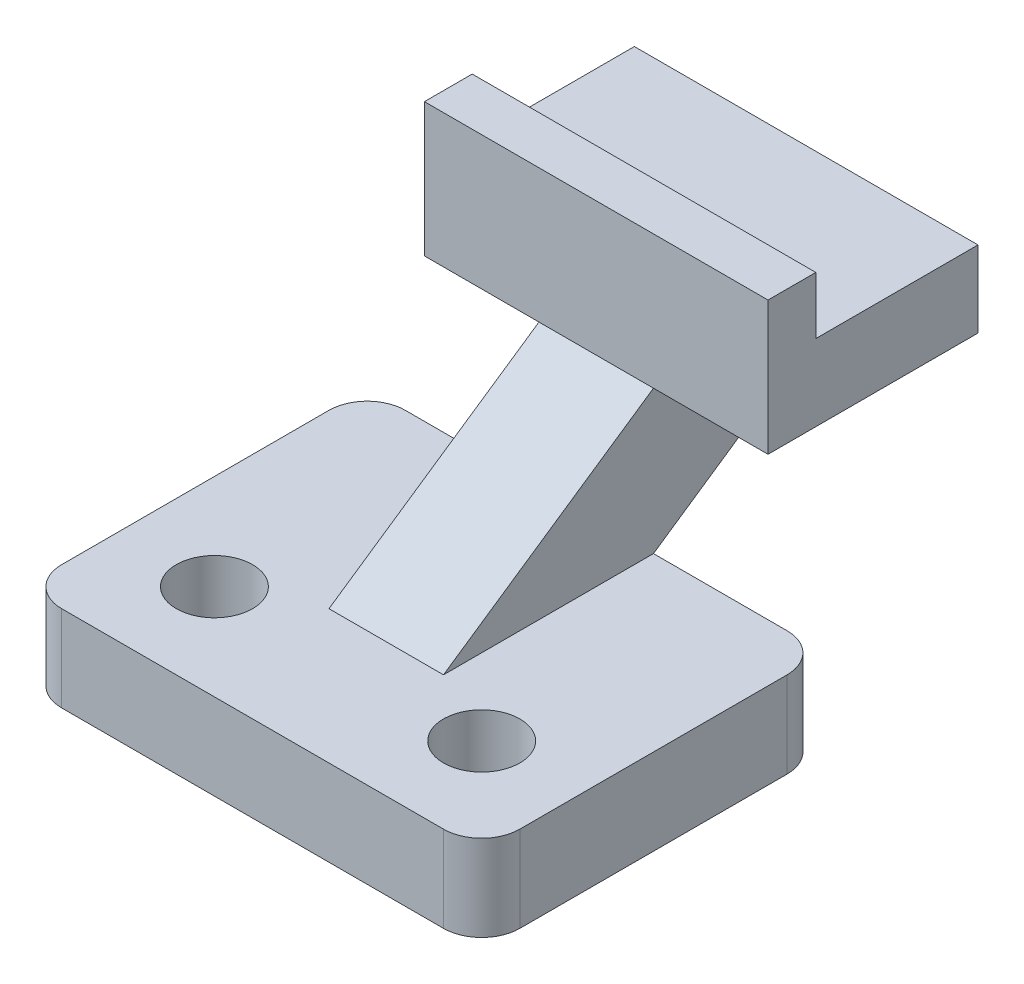
ISO-10303-21;
HEADER;
FILE_DESCRIPTION(('STEP AP214'),'2;1');
FILE_NAME('part.step','',(''),(''),'','','');
FILE_SCHEMA(('AUTOMOTIVE_DESIGN { 1 0 10303 214 1 1 1 1 }'));
ENDSEC;
DATA;
#1=APPLICATION_CONTEXT('core data for automotive mechanical design processes');
#2=APPLICATION_PROTOCOL_DEFINITION('international standard','automotive_design',2000,#1);
#3=PRODUCT_CONTEXT('',#1,'mechanical');
#4=PRODUCT('Part','Part','',(#3));
#5=PRODUCT_RELATED_PRODUCT_CATEGORY('part','',(#4));
#6=PRODUCT_DEFINITION_FORMATION('','',#4);
#7=PRODUCT_DEFINITION_CONTEXT('part definition',#1,'design');
#8=PRODUCT_DEFINITION('design','',#6,#7);
#9=PRODUCT_DEFINITION_SHAPE('','',#8);
#10=(LENGTH_UNIT() NAMED_UNIT(*) SI_UNIT(.MILLI.,.METRE.));
#11=(NAMED_UNIT(*) PLANE_ANGLE_UNIT() SI_UNIT($,.RADIAN.));
#12=(NAMED_UNIT(*) SI_UNIT($,.STERADIAN.) SOLID_ANGLE_UNIT());
#13=UNCERTAINTY_MEASURE_WITH_UNIT(LENGTH_MEASURE(1.E-05),#10,'distance_accuracy_value','');
#14=(GEOMETRIC_REPRESENTATION_CONTEXT(3) GLOBAL_UNCERTAINTY_ASSIGNED_CONTEXT((#13)) GLOBAL_UNIT_ASSIGNED_CONTEXT((#10,
#11,#12)) REPRESENTATION_CONTEXT('',''));
#15=CARTESIAN_POINT('',(0.,0.,0.));
#16=DIRECTION('',(0.,0.,1.));
#17=DIRECTION('',(1.,0.,0.));
#18=AXIS2_PLACEMENT_3D('',#15,#16,#17);
#19=CARTESIAN_POINT('',(-44.0342261904762,23.8252,-49.3447916666667));
#20=DIRECTION('',(1.,0.,0.));
#21=DIRECTION('',(0.,0.,-1.));
#22=AXIS2_PLACEMENT_3D('',#19,#20,#21);
#23=PLANE('',#22);
#24=DIRECTION('',(0.,0.,1.));
#25=VECTOR('',#24,1.);
#26=CARTESIAN_POINT('',(-44.0342261904762,23.8252,-49.3447916666667));
#27=LINE('',#26,#25);
#28=CARTESIAN_POINT('',(-44.0342261904762,23.8252,-49.3447916666667));
#29=VERTEX_POINT('',#28);
#30=CARTESIAN_POINT('',(-44.0342261904762,23.8252,-14.4197916666667));
#31=VERTEX_POINT('',#30);
#32=EDGE_CURVE('E239',#29,#31,#27,.T.);
#33=ORIENTED_EDGE('',*,*,#32,.F.);
#34=DIRECTION('',(0.,-0.563541872734821,0.826087500011065));
#35=VECTOR('',#34,1.);
#36=CARTESIAN_POINT('',(-44.0342261904762,23.8252,-49.3447916666667));
#37=LINE('',#36,#35);
#38=CARTESIAN_POINT('',(-44.0342261904762,0.,-14.4197916666667));
#39=VERTEX_POINT('',#38);
#40=EDGE_CURVE('E223',#29,#39,#37,.T.);
#41=ORIENTED_EDGE('',*,*,#40,.T.);
#42=DIRECTION('',(0.,0.,1.));
#43=VECTOR('',#42,1.);
#44=CARTESIAN_POINT('',(-44.0342261904762,0.,-49.3447916666667));
#45=LINE('',#44,#43);
#46=CARTESIAN_POINT('',(-44.0342261904762,0.,20.5052083333333));
#47=VERTEX_POINT('',#46);
#48=EDGE_CURVE('E251',#39,#47,#45,.T.);
#49=ORIENTED_EDGE('',*,*,#48,.T.);
#50=DIRECTION('',(0.,-0.563541872734821,0.826087500011065));
#51=VECTOR('',#50,1.);
#52=CARTESIAN_POINT('',(-44.0342261904762,40.0840062707072,-38.2533296434497));
#53=LINE('',#52,#51);
#54=EDGE_CURVE('E244',#31,#47,#53,.T.);
#55=ORIENTED_EDGE('',*,*,#54,.F.);
#56=EDGE_LOOP('',(#33,#41,#49,#55));
#57=FACE_BOUND('',#56,.T.);
#58=ADVANCED_FACE('F26',(#57),#23,.F.);
#59=CARTESIAN_POINT('',(-24.9842261904762,23.8252,20.5052083333333));
#60=DIRECTION('',(-1.,0.,0.));
#61=DIRECTION('',(0.,0.,1.));
#62=AXIS2_PLACEMENT_3D('',#59,#60,#61);
#63=PLANE('',#62);
#64=DIRECTION('',(0.,0.,-1.));
#65=VECTOR('',#64,1.);
#66=CARTESIAN_POINT('',(-24.9842261904762,0.,20.5052083333333));
#67=LINE('',#66,#65);
#68=CARTESIAN_POINT('',(-24.9842261904762,0.,20.5052083333333));
#69=VERTEX_POINT('',#68);
#70=CARTESIAN_POINT('',(-24.9842261904762,0.,-14.4197916666667));
#71=VERTEX_POINT('',#70);
#72=EDGE_CURVE('E240',#69,#71,#67,.T.);
#73=ORIENTED_EDGE('',*,*,#72,.T.);
#74=DIRECTION('',(0.,0.563541872734821,-0.826087500011065));
#75=VECTOR('',#74,1.);
#76=CARTESIAN_POINT('',(-24.9842261904762,-8.69241254141447,-1.67771571310069));
#77=LINE('',#76,#75);
#78=CARTESIAN_POINT('',(-24.9842261904762,23.8252,-49.3447916666667));
#79=VERTEX_POINT('',#78);
#80=EDGE_CURVE('E221',#71,#79,#77,.T.);
#81=ORIENTED_EDGE('',*,*,#80,.T.);
#82=DIRECTION('',(0.,0.,-1.));
#83=VECTOR('',#82,1.);
#84=CARTESIAN_POINT('',(-24.9842261904762,23.8252,20.5052083333333));
#85=LINE('',#84,#83);
#86=CARTESIAN_POINT('',(-24.9842261904762,23.8252,-14.4197916666667));
#87=VERTEX_POINT('',#86);
#88=EDGE_CURVE('E233',#87,#79,#85,.T.);
#89=ORIENTED_EDGE('',*,*,#88,.F.);
#90=DIRECTION('',(0.,0.563541872734821,-0.826087500011065));
#91=VECTOR('',#90,1.);
#92=CARTESIAN_POINT('',(-24.9842261904762,7.56639372929277,9.41374631011633));
#93=LINE('',#92,#91);
#94=EDGE_CURVE('E229',#69,#87,#93,.T.);
#95=ORIENTED_EDGE('',*,*,#94,.F.);
#96=EDGE_LOOP('',(#73,#81,#89,#95));
#97=FACE_BOUND('',#96,.T.);
#98=ADVANCED_FACE('F309',(#97),#63,.F.);
#99=CARTESIAN_POINT('',(3.5907738095238,-14.3002,14.1552083333333));
#100=DIRECTION('',(-1.,0.,0.));
#101=DIRECTION('',(0.,0.,1.));
#102=AXIS2_PLACEMENT_3D('',#99,#100,#101);
#103=PLANE('',#102);
#104=DIRECTION('',(0.,0.,1.));
#105=VECTOR('',#104,1.);
#106=CARTESIAN_POINT('',(3.5907738095238,-14.3002,14.1552083333333));
#107=LINE('',#106,#105);
#108=CARTESIAN_POINT('',(3.5907738095238,-14.3002,-8.06979166666667));
#109=VERTEX_POINT('',#108);
#110=CARTESIAN_POINT('',(3.5907738095238,-14.3002,36.3802083333333));
#111=VERTEX_POINT('',#110);
#112=EDGE_CURVE('E284',#109,#111,#107,.T.);
#113=ORIENTED_EDGE('',*,*,#112,.F.);
#114=DIRECTION('',(0.,1.,0.));
#115=VECTOR('',#114,1.);
#116=CARTESIAN_POINT('',(3.5907738095238,-14.3002,-8.06979166666667));
#117=LINE('',#116,#115);
#118=CARTESIAN_POINT('',(3.5907738095238,0.,-8.06979166666667));
#119=VERTEX_POINT('',#118);
#120=EDGE_CURVE('E330',#109,#119,#117,.T.);
#121=ORIENTED_EDGE('',*,*,#120,.T.);
#122=DIRECTION('',(0.,0.,1.));
#123=VECTOR('',#122,1.);
#124=CARTESIAN_POINT('',(3.5907738095238,0.,14.1552083333333));
#125=LINE('',#124,#123);
#126=CARTESIAN_POINT('',(3.5907738095238,0.,36.3802083333333));
#127=VERTEX_POINT('',#126);
#128=EDGE_CURVE('E265',#119,#127,#125,.T.);
#129=ORIENTED_EDGE('',*,*,#128,.T.);
#130=DIRECTION('',(0.,1.,0.));
#131=VECTOR('',#130,1.);
#132=CARTESIAN_POINT('',(3.5907738095238,-14.3002,36.3802083333333));
#133=LINE('',#132,#131);
#134=EDGE_CURVE('E250',#127,#111,#133,.F.);
#135=ORIENTED_EDGE('',*,*,#134,.T.);
#136=EDGE_LOOP('',(#113,#121,#129,#135));
#137=FACE_BOUND('',#136,.T.);
#138=ADVANCED_FACE('F28',(#137),#103,.F.);
#139=CARTESIAN_POINT('',(-108.737760545534,-14.3002,42.7302083333333));
#140=DIRECTION('',(0.,0.,1.));
#141=DIRECTION('',(1.,0.,0.));
#142=AXIS2_PLACEMENT_3D('',#139,#140,#141);
#143=PLANE('',#142);
#144=DIRECTION('',(1.,0.,0.));
#145=VECTOR('',#144,1.);
#146=CARTESIAN_POINT('',(-108.737760545534,-14.3002,42.7302083333333));
#147=LINE('',#146,#145);
#148=CARTESIAN_POINT('',(-66.2592261904762,-14.3002,42.7302083333333));
#149=VERTEX_POINT('',#148);
#150=CARTESIAN_POINT('',(-2.75922619047619,-14.3002,42.7302083333333));
#151=VERTEX_POINT('',#150);
#152=EDGE_CURVE('E292',#149,#151,#147,.T.);
#153=ORIENTED_EDGE('',*,*,#152,.T.);
#154=DIRECTION('',(0.,1.,0.));
#155=VECTOR('',#154,1.);
#156=CARTESIAN_POINT('',(-2.75922619047619,0.,42.7302083333333));
#157=LINE('',#156,#155);
#158=CARTESIAN_POINT('',(-2.75922619047619,0.,42.7302083333333));
#159=VERTEX_POINT('',#158);
#160=EDGE_CURVE('E337',#151,#159,#157,.T.);
#161=ORIENTED_EDGE('',*,*,#160,.T.);
#162=DIRECTION('',(1.,0.,0.));
#163=VECTOR('',#162,1.);
#164=CARTESIAN_POINT('',(-108.737760545534,0.,42.7302083333333));
#165=LINE('',#164,#163);
#166=CARTESIAN_POINT('',(-66.2592261904762,0.,42.7302083333333));
#167=VERTEX_POINT('',#166);
#168=EDGE_CURVE('E275',#167,#159,#165,.T.);
#169=ORIENTED_EDGE('',*,*,#168,.F.);
#170=DIRECTION('',(0.,1.,0.));
#171=VECTOR('',#170,1.);
#172=CARTESIAN_POINT('',(-66.2592261904762,-14.3002,42.7302083333333));
#173=LINE('',#172,#171);
#174=EDGE_CURVE('E339',#167,#149,#173,.F.);
#175=ORIENTED_EDGE('',*,*,#174,.T.);
#176=EDGE_LOOP('',(#153,#161,#169,#175));
#177=FACE_BOUND('',#176,.T.);
#178=ADVANCED_FACE('F373',(#177),#143,.T.);
#179=CARTESIAN_POINT('',(-72.6092261904762,-14.3002,14.1552083333333));
#180=DIRECTION('',(-1.,0.,0.));
#181=DIRECTION('',(0.,0.,1.));
#182=AXIS2_PLACEMENT_3D('',#179,#180,#181);
#183=PLANE('',#182);
#184=DIRECTION('',(0.,0.,1.));
#185=VECTOR('',#184,1.);
#186=CARTESIAN_POINT('',(-72.6092261904762,-14.3002,14.1552083333333));
#187=LINE('',#186,#185);
#188=CARTESIAN_POINT('',(-72.6092261904762,-14.3002,-8.06979166666667));
#189=VERTEX_POINT('',#188);
#190=CARTESIAN_POINT('',(-72.6092261904762,-14.3002,36.3802083333333));
#191=VERTEX_POINT('',#190);
#192=EDGE_CURVE('E290',#189,#191,#187,.T.);
#193=ORIENTED_EDGE('',*,*,#192,.T.);
#194=DIRECTION('',(0.,1.,0.));
#195=VECTOR('',#194,1.);
#196=CARTESIAN_POINT('',(-72.6092261904762,-14.3002,36.3802083333333));
#197=LINE('',#196,#195);
#198=CARTESIAN_POINT('',(-72.6092261904762,0.,36.3802083333333));
#199=VERTEX_POINT('',#198);
#200=EDGE_CURVE('E11',#191,#199,#197,.T.);
#201=ORIENTED_EDGE('',*,*,#200,.T.);
#202=DIRECTION('',(0.,0.,1.));
#203=VECTOR('',#202,1.);
#204=CARTESIAN_POINT('',(-72.6092261904762,0.,14.1552083333333));
#205=LINE('',#204,#203);
#206=CARTESIAN_POINT('',(-72.6092261904762,0.,-8.06979166666667));
#207=VERTEX_POINT('',#206);
#208=EDGE_CURVE('E271',#207,#199,#205,.T.);
#209=ORIENTED_EDGE('',*,*,#208,.F.);
#210=DIRECTION('',(0.,1.,0.));
#211=VECTOR('',#210,1.);
#212=CARTESIAN_POINT('',(-72.6092261904762,-14.3002,-8.06979166666668));
#213=LINE('',#212,#211);
#214=EDGE_CURVE('E34',#207,#189,#213,.F.);
#215=ORIENTED_EDGE('',*,*,#214,.T.);
#216=EDGE_LOOP('',(#193,#201,#209,#215));
#217=FACE_BOUND('',#216,.T.);
#218=ADVANCED_FACE('F332',(#217),#183,.T.);
#219=CARTESIAN_POINT('',(-12.2842261904762,-14.3002,26.8552083333333));
#220=DIRECTION('',(0.,1.,0.));
#221=DIRECTION('',(0.,0.,1.));
#222=AXIS2_PLACEMENT_3D('',#219,#220,#221);
#223=CYLINDRICAL_SURFACE('',#222,6.35);
#224=CARTESIAN_POINT('',(-12.2842261904762,-14.3002,26.8552083333333));
#225=DIRECTION('',(0.,1.,0.));
#226=DIRECTION('',(0.,0.,1.));
#227=AXIS2_PLACEMENT_3D('',#224,#225,#226);
#228=CIRCLE('',#227,6.35);
#229=CARTESIAN_POINT('',(-12.2842261904762,-14.3002,33.2052083333333));
#230=VERTEX_POINT('',#229);
#231=EDGE_CURVE('E295',#230,#230,#228,.T.);
#232=ORIENTED_EDGE('',*,*,#231,.F.);
#233=EDGE_LOOP('',(#232));
#234=FACE_BOUND('',#233,.T.);
#235=CARTESIAN_POINT('',(-12.2842261904762,0.,26.8552083333333));
#236=DIRECTION('',(0.,1.,0.));
#237=DIRECTION('',(0.,0.,1.));
#238=AXIS2_PLACEMENT_3D('',#235,#236,#237);
#239=CIRCLE('',#238,6.35);
#240=CARTESIAN_POINT('',(-12.2842261904762,0.,33.2052083333333));
#241=VERTEX_POINT('',#240);
#242=EDGE_CURVE('E278',#241,#241,#239,.T.);
#243=ORIENTED_EDGE('',*,*,#242,.T.);
#244=EDGE_LOOP('',(#243));
#245=FACE_BOUND('',#244,.T.);
#246=ADVANCED_FACE('F404',(#234,#245),#223,.F.);
#247=CARTESIAN_POINT('',(-108.737760545534,-14.3002,-14.4197916666667));
#248=DIRECTION('',(0.,0.,1.));
#249=DIRECTION('',(1.,0.,0.));
#250=AXIS2_PLACEMENT_3D('',#247,#248,#249);
#251=PLANE('',#250);
#252=DIRECTION('',(1.,0.,0.));
#253=VECTOR('',#252,1.);
#254=CARTESIAN_POINT('',(-108.737760545534,0.,-14.4197916666667));
#255=LINE('',#254,#253);
#256=CARTESIAN_POINT('',(-2.75922619047619,0.,-14.4197916666667));
#257=VERTEX_POINT('',#256);
#258=EDGE_CURVE('E268',#71,#257,#255,.T.);
#259=ORIENTED_EDGE('',*,*,#258,.T.);
#260=DIRECTION('',(0.,1.,0.));
#261=VECTOR('',#260,1.);
#262=CARTESIAN_POINT('',(-2.75922619047619,-14.3002,-14.4197916666667));
#263=LINE('',#262,#261);
#264=CARTESIAN_POINT('',(-2.75922619047619,-14.3002,-14.4197916666667));
#265=VERTEX_POINT('',#264);
#266=EDGE_CURVE('E349',#257,#265,#263,.F.);
#267=ORIENTED_EDGE('',*,*,#266,.T.);
#268=DIRECTION('',(1.,0.,0.));
#269=VECTOR('',#268,1.);
#270=CARTESIAN_POINT('',(-108.737760545534,-14.3002,-14.4197916666667));
#271=LINE('',#270,#269);
#272=CARTESIAN_POINT('',(-66.2592261904762,-14.3002,-14.4197916666667));
#273=VERTEX_POINT('',#272);
#274=EDGE_CURVE('E287',#273,#265,#271,.T.);
#275=ORIENTED_EDGE('',*,*,#274,.F.);
#276=DIRECTION('',(0.,1.,0.));
#277=VECTOR('',#276,1.);
#278=CARTESIAN_POINT('',(-66.2592261904762,0.,-14.4197916666667));
#279=LINE('',#278,#277);
#280=CARTESIAN_POINT('',(-66.2592261904762,0.,-14.4197916666667));
#281=VERTEX_POINT('',#280);
#282=EDGE_CURVE('E351',#273,#281,#279,.T.);
#283=ORIENTED_EDGE('',*,*,#282,.T.);
#284=EDGE_CURVE('E269',#281,#39,#255,.T.);
#285=ORIENTED_EDGE('',*,*,#284,.T.);
#286=EDGE_CURVE('E272',#39,#71,#255,.T.);
#287=ORIENTED_EDGE('',*,*,#286,.T.);
#288=EDGE_LOOP('',(#259,#267,#275,#283,#285,#287));
#289=FACE_BOUND('',#288,.T.);
#290=ADVANCED_FACE('F320',(#289),#251,.F.);
#291=CARTESIAN_POINT('',(-56.7342261904762,-14.3002,26.8552083333333));
#292=DIRECTION('',(0.,1.,0.));
#293=DIRECTION('',(0.,0.,1.));
#294=AXIS2_PLACEMENT_3D('',#291,#292,#293);
#295=CYLINDRICAL_SURFACE('',#294,6.35);
#296=CARTESIAN_POINT('',(-56.7342261904762,-14.3002,26.8552083333333));
#297=DIRECTION('',(0.,1.,0.));
#298=DIRECTION('',(0.,0.,1.));
#299=AXIS2_PLACEMENT_3D('',#296,#297,#298);
#300=CIRCLE('',#299,6.35);
#301=CARTESIAN_POINT('',(-56.7342261904762,-14.3002,33.2052083333333));
#302=VERTEX_POINT('',#301);
#303=EDGE_CURVE('E297',#302,#302,#300,.T.);
#304=ORIENTED_EDGE('',*,*,#303,.F.);
#305=EDGE_LOOP('',(#304));
#306=FACE_BOUND('',#305,.T.);
#307=CARTESIAN_POINT('',(-56.7342261904762,0.,26.8552083333333));
#308=DIRECTION('',(0.,1.,0.));
#309=DIRECTION('',(0.,0.,1.));
#310=AXIS2_PLACEMENT_3D('',#307,#308,#309);
#311=CIRCLE('',#310,6.35);
#312=CARTESIAN_POINT('',(-56.7342261904762,0.,33.2052083333333));
#313=VERTEX_POINT('',#312);
#314=EDGE_CURVE('E281',#313,#313,#311,.T.);
#315=ORIENTED_EDGE('',*,*,#314,.T.);
#316=EDGE_LOOP('',(#315));
#317=FACE_BOUND('',#316,.T.);
#318=ADVANCED_FACE('F401',(#306,#317),#295,.F.);
#319=CARTESIAN_POINT('',(-108.737760545534,-14.3002,14.1552083333333));
#320=DIRECTION('',(0.,1.,0.));
#321=DIRECTION('',(0.,0.,1.));
#322=AXIS2_PLACEMENT_3D('',#319,#320,#321);
#323=PLANE('',#322);
#324=ORIENTED_EDGE('',*,*,#274,.T.);
#325=CARTESIAN_POINT('',(-2.7592261904762,-14.3002,-8.06979166666667));
#326=DIRECTION('',(0.,1.,0.));
#327=DIRECTION('',(0.,0.,1.));
#328=AXIS2_PLACEMENT_3D('',#325,#326,#327);
#329=CIRCLE('',#328,6.35);
#330=EDGE_CURVE('E343',#265,#109,#329,.F.);
#331=ORIENTED_EDGE('',*,*,#330,.T.);
#332=ORIENTED_EDGE('',*,*,#112,.T.);
#333=CARTESIAN_POINT('',(-2.75922619047619,-14.3002,36.3802083333333));
#334=DIRECTION('',(0.,1.,0.));
#335=DIRECTION('',(0.,0.,1.));
#336=AXIS2_PLACEMENT_3D('',#333,#334,#335);
#337=CIRCLE('',#336,6.35);
#338=EDGE_CURVE('E345',#111,#151,#337,.F.);
#339=ORIENTED_EDGE('',*,*,#338,.T.);
#340=ORIENTED_EDGE('',*,*,#152,.F.);
#341=CARTESIAN_POINT('',(-66.2592261904762,-14.3002,36.3802083333333));
#342=DIRECTION('',(0.,1.,0.));
#343=DIRECTION('',(0.,0.,1.));
#344=AXIS2_PLACEMENT_3D('',#341,#342,#343);
#345=CIRCLE('',#344,6.35);
#346=EDGE_CURVE('E41',#149,#191,#345,.F.);
#347=ORIENTED_EDGE('',*,*,#346,.T.);
#348=ORIENTED_EDGE('',*,*,#192,.F.);
#349=CARTESIAN_POINT('',(-66.2592261904762,-14.3002,-8.06979166666668));
#350=DIRECTION('',(0.,1.,0.));
#351=DIRECTION('',(0.,0.,1.));
#352=AXIS2_PLACEMENT_3D('',#349,#350,#351);
#353=CIRCLE('',#352,6.35);
#354=EDGE_CURVE('E336',#189,#273,#353,.F.);
#355=ORIENTED_EDGE('',*,*,#354,.T.);
#356=EDGE_LOOP('',(#324,#331,#332,#339,#340,#347,#348,#355));
#357=FACE_BOUND('',#356,.T.);
#358=ORIENTED_EDGE('',*,*,#231,.T.);
#359=EDGE_LOOP('',(#358));
#360=FACE_BOUND('',#359,.T.);
#361=ORIENTED_EDGE('',*,*,#303,.T.);
#362=EDGE_LOOP('',(#361));
#363=FACE_BOUND('',#362,.T.);
#364=ADVANCED_FACE('F366',(#357,#360,#363),#323,.F.);
#365=CARTESIAN_POINT('',(-108.737760545534,0.,14.1552083333333));
#366=DIRECTION('',(0.,1.,0.));
#367=DIRECTION('',(0.,0.,1.));
#368=AXIS2_PLACEMENT_3D('',#365,#366,#367);
#369=PLANE('',#368);
#370=ORIENTED_EDGE('',*,*,#314,.F.);
#371=EDGE_LOOP('',(#370));
#372=FACE_BOUND('',#371,.T.);
#373=ORIENTED_EDGE('',*,*,#242,.F.);
#374=EDGE_LOOP('',(#373));
#375=FACE_BOUND('',#374,.T.);
#376=ORIENTED_EDGE('',*,*,#128,.F.);
#377=CARTESIAN_POINT('',(-2.7592261904762,0.,-8.06979166666667));
#378=DIRECTION('',(0.,1.,0.));
#379=DIRECTION('',(0.,0.,1.));
#380=AXIS2_PLACEMENT_3D('',#377,#378,#379);
#381=CIRCLE('',#380,6.35);
#382=EDGE_CURVE('E316',#119,#257,#381,.T.);
#383=ORIENTED_EDGE('',*,*,#382,.T.);
#384=ORIENTED_EDGE('',*,*,#258,.F.);
#385=ORIENTED_EDGE('',*,*,#72,.F.);
#386=DIRECTION('',(1.,0.,0.));
#387=VECTOR('',#386,1.);
#388=CARTESIAN_POINT('',(-44.0342261904762,0.,20.5052083333333));
#389=LINE('',#388,#387);
#390=EDGE_CURVE('E255',#47,#69,#389,.T.);
#391=ORIENTED_EDGE('',*,*,#390,.F.);
#392=ORIENTED_EDGE('',*,*,#48,.F.);
#393=ORIENTED_EDGE('',*,*,#284,.F.);
#394=CARTESIAN_POINT('',(-66.2592261904762,0.,-8.06979166666668));
#395=DIRECTION('',(0.,1.,0.));
#396=DIRECTION('',(0.,0.,1.));
#397=AXIS2_PLACEMENT_3D('',#394,#395,#396);
#398=CIRCLE('',#397,6.35);
#399=EDGE_CURVE('E326',#281,#207,#398,.T.);
#400=ORIENTED_EDGE('',*,*,#399,.T.);
#401=ORIENTED_EDGE('',*,*,#208,.T.);
#402=CARTESIAN_POINT('',(-66.2592261904762,0.,36.3802083333333));
#403=DIRECTION('',(0.,1.,0.));
#404=DIRECTION('',(0.,0.,1.));
#405=AXIS2_PLACEMENT_3D('',#402,#403,#404);
#406=CIRCLE('',#405,6.35);
#407=EDGE_CURVE('E329',#199,#167,#406,.T.);
#408=ORIENTED_EDGE('',*,*,#407,.T.);
#409=ORIENTED_EDGE('',*,*,#168,.T.);
#410=CARTESIAN_POINT('',(-2.75922619047619,0.,36.3802083333333));
#411=DIRECTION('',(0.,1.,0.));
#412=DIRECTION('',(0.,0.,1.));
#413=AXIS2_PLACEMENT_3D('',#410,#411,#412);
#414=CIRCLE('',#413,6.35);
#415=EDGE_CURVE('E354',#159,#127,#414,.T.);
#416=ORIENTED_EDGE('',*,*,#415,.T.);
#417=EDGE_LOOP('',(#376,#383,#384,#385,#391,#392,#393,#400,#401,#408,#409,#416));
#418=FACE_BOUND('',#417,.T.);
#419=ADVANCED_FACE('F313',(#372,#375,#418),#369,.T.);
#420=CARTESIAN_POINT('',(3.59077380952381,46.8314523306339,-48.1443086758582));
#421=DIRECTION('',(0.,0.826087500011065,0.563541872734821));
#422=DIRECTION('',(0.,-0.563541872734821,0.826087500011065));
#423=AXIS2_PLACEMENT_3D('',#420,#421,#422);
#424=PLANE('',#423);
#425=ORIENTED_EDGE('',*,*,#54,.T.);
#426=ORIENTED_EDGE('',*,*,#390,.T.);
#427=ORIENTED_EDGE('',*,*,#94,.T.);
#428=DIRECTION('',(1.,0.,0.));
#429=VECTOR('',#428,1.);
#430=CARTESIAN_POINT('',(-44.0342261904762,23.8252,-14.4197916666667));
#431=LINE('',#430,#429);
#432=EDGE_CURVE('E247',#31,#87,#431,.T.);
#433=ORIENTED_EDGE('',*,*,#432,.F.);
#434=EDGE_LOOP('',(#425,#426,#427,#433));
#435=FACE_BOUND('',#434,.T.);
#436=ADVANCED_FACE('F397',(#435),#424,.T.);
#437=CARTESIAN_POINT('',(-200.847170839906,23.8252,-49.3447916666667));
#438=DIRECTION('',(0.,0.826087500011065,0.563541872734821));
#439=DIRECTION('',(0.,-0.563541872734821,0.826087500011065));
#440=AXIS2_PLACEMENT_3D('',#437,#438,#439);
#441=PLANE('',#440);
#442=ORIENTED_EDGE('',*,*,#40,.F.);
#443=DIRECTION('',(-1.,0.,0.));
#444=VECTOR('',#443,1.);
#445=CARTESIAN_POINT('',(-24.9842261904762,23.8252,-49.3447916666667));
#446=LINE('',#445,#444);
#447=EDGE_CURVE('E160',#79,#29,#446,.T.);
#448=ORIENTED_EDGE('',*,*,#447,.F.);
#449=ORIENTED_EDGE('',*,*,#80,.F.);
#450=ORIENTED_EDGE('',*,*,#286,.F.);
#451=EDGE_LOOP('',(#442,#448,#449,#450));
#452=FACE_BOUND('',#451,.T.);
#453=ADVANCED_FACE('F324',(#452),#441,.F.);
#454=CARTESIAN_POINT('',(-5.9342261904762,23.8252,-14.4197916666667));
#455=DIRECTION('',(0.,1.,0.));
#456=DIRECTION('',(0.,0.,1.));
#457=AXIS2_PLACEMENT_3D('',#454,#455,#456);
#458=PLANE('',#457);
#459=DIRECTION('',(-1.,0.,0.));
#460=VECTOR('',#459,1.);
#461=CARTESIAN_POINT('',(-5.9342261904762,23.8252,-49.3447916666667));
#462=LINE('',#461,#460);
#463=CARTESIAN_POINT('',(-63.0842261904762,23.8252,-49.3447916666667));
#464=VERTEX_POINT('',#463);
#465=EDGE_CURVE('E153',#29,#464,#462,.T.);
#466=ORIENTED_EDGE('',*,*,#465,.F.);
#467=ORIENTED_EDGE('',*,*,#32,.T.);
#468=DIRECTION('',(-1.,0.,0.));
#469=VECTOR('',#468,1.);
#470=CARTESIAN_POINT('',(-5.9342261904762,23.8252,-14.4197916666667));
#471=LINE('',#470,#469);
#472=CARTESIAN_POINT('',(-63.0842261904762,23.8252,-14.4197916666667));
#473=VERTEX_POINT('',#472);
#474=EDGE_CURVE('E180',#31,#473,#471,.T.);
#475=ORIENTED_EDGE('',*,*,#474,.T.);
#476=DIRECTION('',(0.,0.,-1.));
#477=VECTOR('',#476,1.);
#478=CARTESIAN_POINT('',(-63.0842261904762,23.8252,-14.4197916666667));
#479=LINE('',#478,#477);
#480=EDGE_CURVE('E172',#473,#464,#479,.T.);
#481=ORIENTED_EDGE('',*,*,#480,.T.);
#482=EDGE_LOOP('',(#466,#467,#475,#481));
#483=FACE_BOUND('',#482,.T.);
#484=ADVANCED_FACE('F178',(#483),#458,.F.);
#485=CARTESIAN_POINT('',(-5.9342261904762,23.8252,-14.4197916666667));
#486=VERTEX_POINT('',#485);
#487=EDGE_CURVE('E213',#486,#87,#471,.T.);
#488=ORIENTED_EDGE('',*,*,#487,.T.);
#489=ORIENTED_EDGE('',*,*,#88,.T.);
#490=CARTESIAN_POINT('',(-5.9342261904762,23.8252,-49.3447916666667));
#491=VERTEX_POINT('',#490);
#492=EDGE_CURVE('E164',#491,#79,#462,.T.);
#493=ORIENTED_EDGE('',*,*,#492,.F.);
#494=DIRECTION('',(0.,0.,-1.));
#495=VECTOR('',#494,1.);
#496=CARTESIAN_POINT('',(-5.9342261904762,23.8252,-14.4197916666667));
#497=LINE('',#496,#495);
#498=EDGE_CURVE('E192',#486,#491,#497,.T.);
#499=ORIENTED_EDGE('',*,*,#498,.F.);
#500=EDGE_LOOP('',(#488,#489,#493,#499));
#501=FACE_BOUND('',#500,.T.);
#502=ADVANCED_FACE('F500',(#501),#458,.F.);
#503=CARTESIAN_POINT('',(-5.9342261904762,36.5252,-49.3447916666667));
#504=DIRECTION('',(0.,0.,1.));
#505=DIRECTION('',(0.,-1.,0.));
#506=AXIS2_PLACEMENT_3D('',#503,#504,#505);
#507=PLANE('',#506);
#508=ORIENTED_EDGE('',*,*,#492,.T.);
#509=ORIENTED_EDGE('',*,*,#447,.T.);
#510=ORIENTED_EDGE('',*,*,#465,.T.);
#511=DIRECTION('',(0.,1.,0.));
#512=VECTOR('',#511,1.);
#513=CARTESIAN_POINT('',(-63.0842261904762,36.5252,-49.3447916666667));
#514=LINE('',#513,#512);
#515=CARTESIAN_POINT('',(-63.0842261904762,36.5252,-49.3447916666667));
#516=VERTEX_POINT('',#515);
#517=EDGE_CURVE('E158',#464,#516,#514,.T.);
#518=ORIENTED_EDGE('',*,*,#517,.T.);
#519=DIRECTION('',(-1.,0.,0.));
#520=VECTOR('',#519,1.);
#521=CARTESIAN_POINT('',(-5.9342261904762,36.5252,-49.3447916666667));
#522=LINE('',#521,#520);
#523=CARTESIAN_POINT('',(-5.9342261904762,36.5252,-49.3447916666667));
#524=VERTEX_POINT('',#523);
#525=EDGE_CURVE('E165',#524,#516,#522,.T.);
#526=ORIENTED_EDGE('',*,*,#525,.F.);
#527=DIRECTION('',(0.,1.,0.));
#528=VECTOR('',#527,1.);
#529=CARTESIAN_POINT('',(-5.9342261904762,36.5252,-49.3447916666667));
#530=LINE('',#529,#528);
#531=EDGE_CURVE('E195',#491,#524,#530,.T.);
#532=ORIENTED_EDGE('',*,*,#531,.F.);
#533=EDGE_LOOP('',(#508,#509,#510,#518,#526,#532));
#534=FACE_BOUND('',#533,.T.);
#535=ADVANCED_FACE('F156',(#534),#507,.F.);
#536=CARTESIAN_POINT('',(-5.9342261904762,36.5252,-22.3699916666667));
#537=DIRECTION('',(0.,-1.,0.));
#538=DIRECTION('',(0.,0.,-1.));
#539=AXIS2_PLACEMENT_3D('',#536,#537,#538);
#540=PLANE('',#539);
#541=ORIENTED_EDGE('',*,*,#525,.T.);
#542=DIRECTION('',(0.,0.,1.));
#543=VECTOR('',#542,1.);
#544=CARTESIAN_POINT('',(-63.0842261904762,36.5252,-22.3699916666667));
#545=LINE('',#544,#543);
#546=CARTESIAN_POINT('',(-63.0842261904762,36.5252,-22.3699916666667));
#547=VERTEX_POINT('',#546);
#548=EDGE_CURVE('E176',#516,#547,#545,.T.);
#549=ORIENTED_EDGE('',*,*,#548,.T.);
#550=DIRECTION('',(-1.,0.,0.));
#551=VECTOR('',#550,1.);
#552=CARTESIAN_POINT('',(-5.9342261904762,36.5252,-22.3699916666667));
#553=LINE('',#552,#551);
#554=CARTESIAN_POINT('',(-5.9342261904762,36.5252,-22.3699916666667));
#555=VERTEX_POINT('',#554);
#556=EDGE_CURVE('E539',#555,#547,#553,.T.);
#557=ORIENTED_EDGE('',*,*,#556,.F.);
#558=DIRECTION('',(0.,0.,1.));
#559=VECTOR('',#558,1.);
#560=CARTESIAN_POINT('',(-5.9342261904762,36.5252,-22.3699916666667));
#561=LINE('',#560,#559);
#562=EDGE_CURVE('E197',#524,#555,#561,.T.);
#563=ORIENTED_EDGE('',*,*,#562,.F.);
#564=EDGE_LOOP('',(#541,#549,#557,#563));
#565=FACE_BOUND('',#564,.T.);
#566=ADVANCED_FACE('F485',(#565),#540,.F.);
#567=CARTESIAN_POINT('',(-5.9342261904762,46.0502,-22.3699916666667));
#568=DIRECTION('',(0.,0.,1.));
#569=DIRECTION('',(1.,0.,0.));
#570=AXIS2_PLACEMENT_3D('',#567,#568,#569);
#571=PLANE('',#570);
#572=ORIENTED_EDGE('',*,*,#556,.T.);
#573=DIRECTION('',(0.,1.,0.));
#574=VECTOR('',#573,1.);
#575=CARTESIAN_POINT('',(-63.0842261904762,46.0502,-22.3699916666667));
#576=LINE('',#575,#574);
#577=CARTESIAN_POINT('',(-63.0842261904762,46.0502,-22.3699916666667));
#578=VERTEX_POINT('',#577);
#579=EDGE_CURVE('E184',#547,#578,#576,.T.);
#580=ORIENTED_EDGE('',*,*,#579,.T.);
#581=DIRECTION('',(-1.,0.,0.));
#582=VECTOR('',#581,1.);
#583=CARTESIAN_POINT('',(-5.9342261904762,46.0502,-22.3699916666667));
#584=LINE('',#583,#582);
#585=CARTESIAN_POINT('',(-5.9342261904762,46.0502,-22.3699916666667));
#586=VERTEX_POINT('',#585);
#587=EDGE_CURVE('E536',#586,#578,#584,.T.);
#588=ORIENTED_EDGE('',*,*,#587,.F.);
#589=DIRECTION('',(0.,1.,0.));
#590=VECTOR('',#589,1.);
#591=CARTESIAN_POINT('',(-5.9342261904762,46.0502,-22.3699916666667));
#592=LINE('',#591,#590);
#593=EDGE_CURVE('E199',#555,#586,#592,.T.);
#594=ORIENTED_EDGE('',*,*,#593,.F.);
#595=EDGE_LOOP('',(#572,#580,#588,#594));
#596=FACE_BOUND('',#595,.T.);
#597=ADVANCED_FACE('F477',(#596),#571,.F.);
#598=CARTESIAN_POINT('',(-5.9342261904762,46.0502,-14.4197916666667));
#599=DIRECTION('',(0.,-1.,0.));
#600=DIRECTION('',(0.,0.,-1.));
#601=AXIS2_PLACEMENT_3D('',#598,#599,#600);
#602=PLANE('',#601);
#603=ORIENTED_EDGE('',*,*,#587,.T.);
#604=DIRECTION('',(0.,0.,1.));
#605=VECTOR('',#604,1.);
#606=CARTESIAN_POINT('',(-63.0842261904762,46.0502,-14.4197916666667));
#607=LINE('',#606,#605);
#608=CARTESIAN_POINT('',(-63.0842261904762,46.0502,-14.4197916666667));
#609=VERTEX_POINT('',#608);
#610=EDGE_CURVE('E187',#578,#609,#607,.T.);
#611=ORIENTED_EDGE('',*,*,#610,.T.);
#612=DIRECTION('',(-1.,0.,0.));
#613=VECTOR('',#612,1.);
#614=CARTESIAN_POINT('',(-5.9342261904762,46.0502,-14.4197916666667));
#615=LINE('',#614,#613);
#616=CARTESIAN_POINT('',(-5.9342261904762,46.0502,-14.4197916666667));
#617=VERTEX_POINT('',#616);
#618=EDGE_CURVE('E207',#617,#609,#615,.T.);
#619=ORIENTED_EDGE('',*,*,#618,.F.);
#620=DIRECTION('',(0.,0.,1.));
#621=VECTOR('',#620,1.);
#622=CARTESIAN_POINT('',(-5.9342261904762,46.0502,-14.4197916666667));
#623=LINE('',#622,#621);
#624=EDGE_CURVE('E201',#586,#617,#623,.T.);
#625=ORIENTED_EDGE('',*,*,#624,.F.);
#626=EDGE_LOOP('',(#603,#611,#619,#625));
#627=FACE_BOUND('',#626,.T.);
#628=ADVANCED_FACE('F469',(#627),#602,.F.);
#629=CARTESIAN_POINT('',(-5.9342261904762,23.8252,-14.4197916666667));
#630=DIRECTION('',(0.,0.,-1.));
#631=DIRECTION('',(-1.,0.,0.));
#632=AXIS2_PLACEMENT_3D('',#629,#630,#631);
#633=PLANE('',#632);
#634=ORIENTED_EDGE('',*,*,#618,.T.);
#635=DIRECTION('',(0.,-1.,0.));
#636=VECTOR('',#635,1.);
#637=CARTESIAN_POINT('',(-63.0842261904762,23.8252,-14.4197916666667));
#638=LINE('',#637,#636);
#639=EDGE_CURVE('E190',#609,#473,#638,.T.);
#640=ORIENTED_EDGE('',*,*,#639,.T.);
#641=ORIENTED_EDGE('',*,*,#474,.F.);
#642=ORIENTED_EDGE('',*,*,#432,.T.);
#643=ORIENTED_EDGE('',*,*,#487,.F.);
#644=DIRECTION('',(0.,-1.,0.));
#645=VECTOR('',#644,1.);
#646=CARTESIAN_POINT('',(-5.9342261904762,23.8252,-14.4197916666667));
#647=LINE('',#646,#645);
#648=EDGE_CURVE('E203',#617,#486,#647,.T.);
#649=ORIENTED_EDGE('',*,*,#648,.F.);
#650=EDGE_LOOP('',(#634,#640,#641,#642,#643,#649));
#651=FACE_BOUND('',#650,.T.);
#652=ADVANCED_FACE('F461',(#651),#633,.F.);
#653=CARTESIAN_POINT('',(-5.9342261904762,23.8252,-22.3699916666667));
#654=DIRECTION('',(-1.,0.,0.));
#655=DIRECTION('',(0.,0.,1.));
#656=AXIS2_PLACEMENT_3D('',#653,#654,#655);
#657=PLANE('',#656);
#658=ORIENTED_EDGE('',*,*,#498,.T.);
#659=ORIENTED_EDGE('',*,*,#531,.T.);
#660=ORIENTED_EDGE('',*,*,#562,.T.);
#661=ORIENTED_EDGE('',*,*,#593,.T.);
#662=ORIENTED_EDGE('',*,*,#624,.T.);
#663=ORIENTED_EDGE('',*,*,#648,.T.);
#664=EDGE_LOOP('',(#658,#659,#660,#661,#662,#663));
#665=FACE_BOUND('',#664,.T.);
#666=ADVANCED_FACE('F453',(#665),#657,.F.);
#667=CARTESIAN_POINT('',(-63.0842261904762,23.8252,-22.3699916666667));
#668=DIRECTION('',(-1.,0.,0.));
#669=DIRECTION('',(0.,0.,1.));
#670=AXIS2_PLACEMENT_3D('',#667,#668,#669);
#671=PLANE('',#670);
#672=ORIENTED_EDGE('',*,*,#480,.F.);
#673=ORIENTED_EDGE('',*,*,#639,.F.);
#674=ORIENTED_EDGE('',*,*,#610,.F.);
#675=ORIENTED_EDGE('',*,*,#579,.F.);
#676=ORIENTED_EDGE('',*,*,#548,.F.);
#677=ORIENTED_EDGE('',*,*,#517,.F.);
#678=EDGE_LOOP('',(#672,#673,#674,#675,#676,#677));
#679=FACE_BOUND('',#678,.T.);
#680=ADVANCED_FACE('F170',(#679),#671,.T.);
#681=CARTESIAN_POINT('',(-2.7592261904762,-14.3002,-8.06979166666667));
#682=DIRECTION('',(0.,1.,0.));
#683=DIRECTION('',(0.,0.,1.));
#684=AXIS2_PLACEMENT_3D('',#681,#682,#683);
#685=CYLINDRICAL_SURFACE('',#684,6.35);
#686=ORIENTED_EDGE('',*,*,#330,.F.);
#687=ORIENTED_EDGE('',*,*,#266,.F.);
#688=ORIENTED_EDGE('',*,*,#382,.F.);
#689=ORIENTED_EDGE('',*,*,#120,.F.);
#690=EDGE_LOOP('',(#686,#687,#688,#689));
#691=FACE_BOUND('',#690,.T.);
#692=ADVANCED_FACE('F384',(#691),#685,.T.);
#693=CARTESIAN_POINT('',(-2.75922619047619,-14.3002,36.3802083333333));
#694=DIRECTION('',(0.,-1.,0.));
#695=DIRECTION('',(0.,0.,-1.));
#696=AXIS2_PLACEMENT_3D('',#693,#694,#695);
#697=CYLINDRICAL_SURFACE('',#696,6.35);
#698=ORIENTED_EDGE('',*,*,#338,.F.);
#699=ORIENTED_EDGE('',*,*,#134,.F.);
#700=ORIENTED_EDGE('',*,*,#415,.F.);
#701=ORIENTED_EDGE('',*,*,#160,.F.);
#702=EDGE_LOOP('',(#698,#699,#700,#701));
#703=FACE_BOUND('',#702,.T.);
#704=ADVANCED_FACE('F370',(#703),#697,.T.);
#705=CARTESIAN_POINT('',(-66.2592261904762,-14.3002,36.3802083333333));
#706=DIRECTION('',(0.,1.,0.));
#707=DIRECTION('',(0.,0.,1.));
#708=AXIS2_PLACEMENT_3D('',#705,#706,#707);
#709=CYLINDRICAL_SURFACE('',#708,6.35);
#710=ORIENTED_EDGE('',*,*,#346,.F.);
#711=ORIENTED_EDGE('',*,*,#174,.F.);
#712=ORIENTED_EDGE('',*,*,#407,.F.);
#713=ORIENTED_EDGE('',*,*,#200,.F.);
#714=EDGE_LOOP('',(#710,#711,#712,#713));
#715=FACE_BOUND('',#714,.T.);
#716=ADVANCED_FACE('F376',(#715),#709,.T.);
#717=CARTESIAN_POINT('',(-66.2592261904762,-14.3002,-8.06979166666668));
#718=DIRECTION('',(0.,-1.,0.));
#719=DIRECTION('',(0.,0.,-1.));
#720=AXIS2_PLACEMENT_3D('',#717,#718,#719);
#721=CYLINDRICAL_SURFACE('',#720,6.35);
#722=ORIENTED_EDGE('',*,*,#354,.F.);
#723=ORIENTED_EDGE('',*,*,#214,.F.);
#724=ORIENTED_EDGE('',*,*,#399,.F.);
#725=ORIENTED_EDGE('',*,*,#282,.F.);
#726=EDGE_LOOP('',(#722,#723,#724,#725));
#727=FACE_BOUND('',#726,.T.);
#728=ADVANCED_FACE('F335',(#727),#721,.T.);
#729=CLOSED_SHELL('',(#58,#98,#138,#178,#218,#246,#290,#318,#364,#419,#436,#453,#484,#502,#535,
#566,#597,#628,#652,#666,#680,#692,#704,#716,#728));
#730=MANIFOLD_SOLID_BREP('B2',#729);
#731=ADVANCED_BREP_SHAPE_REPRESENTATION('',(#18,#730),#14);
#732=SHAPE_DEFINITION_REPRESENTATION(#9,#731);
ENDSEC;
END-ISO-10303-21;
